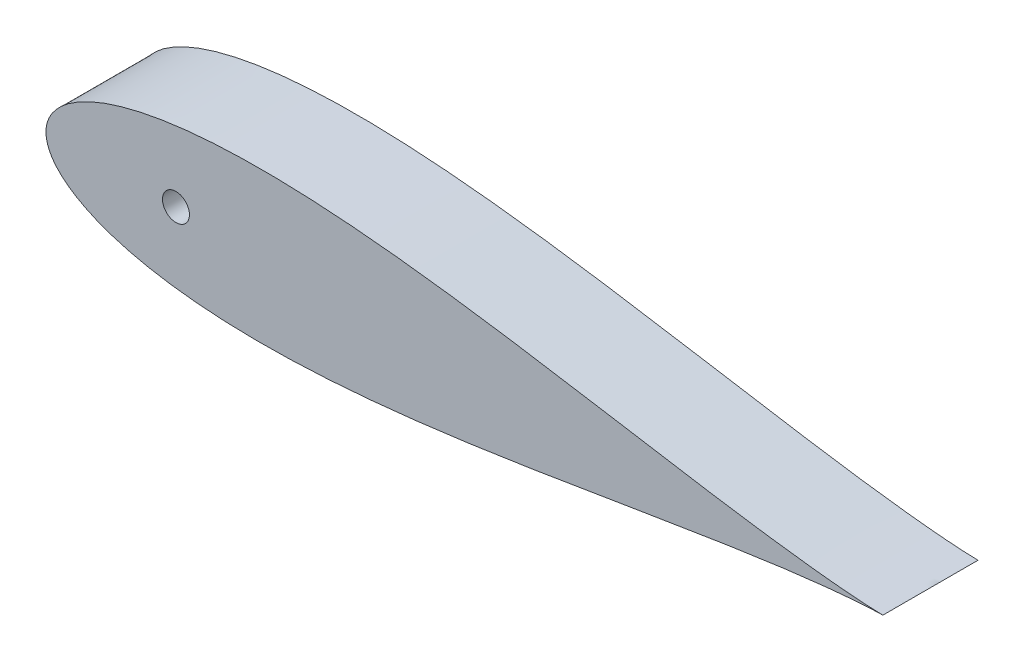
ISO-10303-21;
HEADER;
FILE_DESCRIPTION(('STEP AP214'),'2;1');
FILE_NAME('part.step','',(''),(''),'','','');
FILE_SCHEMA(('AUTOMOTIVE_DESIGN { 1 0 10303 214 1 1 1 1 }'));
ENDSEC;
DATA;
#1=APPLICATION_CONTEXT('core data for automotive mechanical design processes');
#2=APPLICATION_PROTOCOL_DEFINITION('international standard','automotive_design',2000,#1);
#3=PRODUCT_CONTEXT('',#1,'mechanical');
#4=PRODUCT('Part','Part','',(#3));
#5=PRODUCT_RELATED_PRODUCT_CATEGORY('part','',(#4));
#6=PRODUCT_DEFINITION_FORMATION('','',#4);
#7=PRODUCT_DEFINITION_CONTEXT('part definition',#1,'design');
#8=PRODUCT_DEFINITION('design','',#6,#7);
#9=PRODUCT_DEFINITION_SHAPE('','',#8);
#10=(LENGTH_UNIT() NAMED_UNIT(*) SI_UNIT(.MILLI.,.METRE.));
#11=(NAMED_UNIT(*) PLANE_ANGLE_UNIT() SI_UNIT($,.RADIAN.));
#12=(NAMED_UNIT(*) SI_UNIT($,.STERADIAN.) SOLID_ANGLE_UNIT());
#13=UNCERTAINTY_MEASURE_WITH_UNIT(LENGTH_MEASURE(1.E-05),#10,'distance_accuracy_value','');
#14=(GEOMETRIC_REPRESENTATION_CONTEXT(3) GLOBAL_UNCERTAINTY_ASSIGNED_CONTEXT((#13)) GLOBAL_UNIT_ASSIGNED_CONTEXT((#10,
#11,#12)) REPRESENTATION_CONTEXT('',''));
#15=CARTESIAN_POINT('',(0.,0.,0.));
#16=DIRECTION('',(0.,0.,1.));
#17=DIRECTION('',(1.,0.,0.));
#18=AXIS2_PLACEMENT_3D('',#15,#16,#17);
#19=CARTESIAN_POINT('',(670.56,0.,76.2));
#20=CARTESIAN_POINT('',(670.56,0.0156785949268131,76.2));
#21=CARTESIAN_POINT('',(666.344759682885,0.0546967077380254,76.2));
#22=CARTESIAN_POINT('',(662.850933167967,0.234427605388554,76.2));
#23=CARTESIAN_POINT('',(656.504964310749,0.543558382914671,76.2));
#24=CARTESIAN_POINT('',(649.292951764021,1.03477125279464,76.2));
#25=CARTESIAN_POINT('',(640.49155963975,1.73191957841822,76.2));
#26=CARTESIAN_POINT('',(630.413817461935,2.6633854932203,76.2));
#27=CARTESIAN_POINT('',(619.014124193102,3.84925366408521,76.2));
#28=CARTESIAN_POINT('',(606.37498851238,5.30442898343123,76.2));
#29=CARTESIAN_POINT('',(592.543922516217,7.03763490710039,76.2));
#30=CARTESIAN_POINT('',(577.585454095337,9.05063614704163,76.2));
#31=CARTESIAN_POINT('',(561.564270734499,11.338919624911,76.2));
#32=CARTESIAN_POINT('',(544.549749945783,13.8906653749143,76.2));
#33=CARTESIAN_POINT('',(526.614143657614,16.687720752969,76.2));
#34=CARTESIAN_POINT('',(507.832591566438,19.705111662944,76.2));
#35=CARTESIAN_POINT('',(488.28271028846,22.9116726009051,76.2));
#36=CARTESIAN_POINT('',(468.04436773457,26.2704360601485,76.2));
#37=CARTESIAN_POINT('',(447.199424328287,29.7390074319526,76.2));
#38=CARTESIAN_POINT('',(425.831595832134,33.2703241206413,76.2));
#39=CARTESIAN_POINT('',(404.026315660115,36.8132205450789,76.2));
#40=CARTESIAN_POINT('',(381.870662855574,40.3132668564462,76.2));
#41=CARTESIAN_POINT('',(359.45331489519,43.7135025323023,76.2));
#42=CARTESIAN_POINT('',(336.864544150043,46.9554474567625,76.2));
#43=CARTESIAN_POINT('',(314.196207315012,49.9798438951445,76.2));
#44=CARTESIAN_POINT('',(291.541767703989,52.7277127038914,76.2));
#45=CARTESIAN_POINT('',(268.996310773138,55.1412010116265,76.2));
#46=CARTESIAN_POINT('',(246.656558649997,57.164603828805,76.2));
#47=CARTESIAN_POINT('',(224.620860897201,58.7451766411797,76.2));
#48=CARTESIAN_POINT('',(202.989192599403,59.8341217002378,76.2));
#49=CARTESIAN_POINT('',(181.863132616042,60.38750614212,76.2));
#50=CARTESIAN_POINT('',(161.345829026568,60.3669613241372,76.2));
#51=CARTESIAN_POINT('',(141.542033827972,59.7398958243377,76.2));
#52=CARTESIAN_POINT('',(122.558104572902,58.4817581038394,76.2));
#53=CARTESIAN_POINT('',(104.502313427195,56.5743039322433,76.2));
#54=CARTESIAN_POINT('',(87.4850186361547,54.0089351991654,76.2));
#55=CARTESIAN_POINT('',(71.6196960831899,50.7847520029957,76.2));
#56=CARTESIAN_POINT('',(57.0237097246999,46.9125430655859,76.2));
#57=CARTESIAN_POINT('',(43.8204543300276,42.4150024601016,76.2));
#58=CARTESIAN_POINT('',(32.1416452388822,37.3322040286461,76.2));
#59=CARTESIAN_POINT('',(22.1291073753192,31.7314553388245,76.2));
#60=CARTESIAN_POINT('',(13.9324235239131,25.7264121059535,76.2));
#61=CARTESIAN_POINT('',(7.6896164890983,19.5132076319135,76.2));
#62=CARTESIAN_POINT('',(3.46313634309125,13.420354420661,76.2));
#63=CARTESIAN_POINT('',(1.10633322756685,7.92338943472272,76.2));
#64=CARTESIAN_POINT('',(0.15461158157361,3.51379661507287,76.2));
#65=CARTESIAN_POINT('',(-0.0621515976067641,1.5591281566194E-13,76.2));
#66=CARTESIAN_POINT('',(0.154611581573626,-3.51379661507311,76.2));
#67=CARTESIAN_POINT('',(1.10633322756686,-7.92338943472269,76.2));
#68=CARTESIAN_POINT('',(3.46313634309125,-13.420354420661,76.2));
#69=CARTESIAN_POINT('',(7.68961648909825,-19.5132076319134,76.2));
#70=CARTESIAN_POINT('',(13.9324235239131,-25.7264121059535,76.2));
#71=CARTESIAN_POINT('',(22.1291073753193,-31.7314553388245,76.2));
#72=CARTESIAN_POINT('',(32.1416452388821,-37.3322040286461,76.2));
#73=CARTESIAN_POINT('',(43.8204543300276,-42.4150024601017,76.2));
#74=CARTESIAN_POINT('',(57.0237097246998,-46.9125430655859,76.2));
#75=CARTESIAN_POINT('',(71.6196960831899,-50.7847520029958,76.2));
#76=CARTESIAN_POINT('',(87.4850186361546,-54.0089351991654,76.2));
#77=CARTESIAN_POINT('',(104.502313427195,-56.5743039322434,76.2));
#78=CARTESIAN_POINT('',(122.558104572901,-58.4817581038394,76.2));
#79=CARTESIAN_POINT('',(141.542033827972,-59.7398958243377,76.2));
#80=CARTESIAN_POINT('',(161.345829026568,-60.3669613241371,76.2));
#81=CARTESIAN_POINT('',(181.863132616042,-60.38750614212,76.2));
#82=CARTESIAN_POINT('',(202.989192599403,-59.8341217002379,76.2));
#83=CARTESIAN_POINT('',(224.620860897201,-58.7451766411797,76.2));
#84=CARTESIAN_POINT('',(246.656558649997,-57.164603828805,76.2));
#85=CARTESIAN_POINT('',(268.996310773138,-55.1412010116265,76.2));
#86=CARTESIAN_POINT('',(291.541767703989,-52.7277127038914,76.2));
#87=CARTESIAN_POINT('',(314.196207315012,-49.9798438951445,76.2));
#88=CARTESIAN_POINT('',(336.864544150043,-46.9554474567625,76.2));
#89=CARTESIAN_POINT('',(359.45331489519,-43.7135025323023,76.2));
#90=CARTESIAN_POINT('',(381.870662855574,-40.3132668564462,76.2));
#91=CARTESIAN_POINT('',(404.026315660115,-36.8132205450789,76.2));
#92=CARTESIAN_POINT('',(425.831595832134,-33.2703241206413,76.2));
#93=CARTESIAN_POINT('',(447.199424328287,-29.7390074319526,76.2));
#94=CARTESIAN_POINT('',(468.04436773457,-26.2704360601485,76.2));
#95=CARTESIAN_POINT('',(488.28271028846,-22.911672600905,76.2));
#96=CARTESIAN_POINT('',(507.832591566438,-19.7051116629441,76.2));
#97=CARTESIAN_POINT('',(526.614143657614,-16.687720752969,76.2));
#98=CARTESIAN_POINT('',(544.549749945782,-13.8906653749143,76.2));
#99=CARTESIAN_POINT('',(561.564270734499,-11.338919624911,76.2));
#100=CARTESIAN_POINT('',(577.585454095337,-9.05063614704163,76.2));
#101=CARTESIAN_POINT('',(592.543922516217,-7.03763490710038,76.2));
#102=CARTESIAN_POINT('',(606.37498851238,-5.30442898343123,76.2));
#103=CARTESIAN_POINT('',(619.014124193101,-3.84925366408522,76.2));
#104=CARTESIAN_POINT('',(630.413817461935,-2.6633854932203,76.2));
#105=CARTESIAN_POINT('',(640.491559639751,-1.73191957841821,76.2));
#106=CARTESIAN_POINT('',(649.29295176402,-1.03477125279464,76.2));
#107=CARTESIAN_POINT('',(656.504964310749,-0.543558382914674,76.2));
#108=CARTESIAN_POINT('',(662.850933167967,-0.23442760538855,76.2));
#109=CARTESIAN_POINT('',(666.344759682885,-0.0546967077380269,76.2));
#110=CARTESIAN_POINT('',(670.56,-0.0156785949268135,76.2));
#111=CARTESIAN_POINT('',(670.56,0.,76.2));
#112=B_SPLINE_CURVE_WITH_KNOTS('',3,(#19,#20,#21,#22,#23,#24,#25,#26,#27,#28,#29,#30,#31,#32,
#33,#34,#35,#36,#37,#38,#39,#40,#41,#42,#43,#44,#45,#46,#47,#48,#49,#50,#51,#52,#53,#54,#55,#56,
#57,#58,#59,#60,#61,#62,#63,#64,#65,#66,#67,#68,#69,#70,#71,#72,#73,#74,#75,#76,#77,#78,#79,#80,
#81,#82,#83,#84,#85,#86,#87,#88,#89,#90,#91,#92,#93,#94,#95,#96,#97,#98,#99,#100,#101,#102,#103,
#104,#105,#106,#107,#108,#109,#110,#111),.UNSPECIFIED.,.T.,.F.,(4,1,1,1,1,1,1,1,1,1,1,1,1,1,1,1,
1,1,1,1,1,1,1,1,1,1,1,1,1,1,1,1,1,1,1,1,1,1,1,1,1,1,1,1,1,1,1,1,1,1,1,1,1,1,1,1,1,1,1,1,1,1,1,1,
1,1,1,1,1,1,1,1,1,1,1,1,1,1,1,1,1,1,1,1,1,1,1,1,1,1,4),(0.,0.00216777795588342,
0.00539478220000884,0.00966720698444134,0.0149667883303173,0.0212708876900959,
0.0285525550130683,0.0367806836725549,0.0459201019032637,0.0559317636633187,0.0667728836144854,
0.0783971303496518,0.0907548266908363,0.103793164577546,0.117456431914319,0.131686225652521,
0.146421738497113,0.161599998000845,0.177156132626574,0.193023668070302,0.209134785631037,
0.225420632511523,0.241811601924249,0.258237646860869,0.274628556698349,0.290914287398014,
0.307025228908797,0.322892517177238,0.33844834182358,0.353626206573582,0.368361231970712,
0.382590427827798,0.396252960572084,0.40929041186716,0.421647009590256,0.433269881487031,
0.444109248914041,0.454118639688981,0.463255054987312,0.471479113777303,0.478755288570903,
0.485052318112802,0.490344025694165,0.494609832614287,0.497833231437255,0.5,0.502166768562745,
0.505390167385713,0.509655974305835,0.514947681887198,0.521244711429097,0.528520886222697,
0.536744945012688,0.545881360311019,0.555890751085959,0.566730118512969,0.578352990409744,
0.59070958813284,0.603747039427916,0.617409572172202,0.631638768029288,0.646373793426418,
0.66155165817642,0.677107482822761,0.692974771091203,0.709085712601986,0.725371443301651,
0.741762353139131,0.758188398075751,0.774579367488477,0.790865214368963,0.806976331929698,
0.822843867373426,0.838400001999155,0.853578261502887,0.868313774347479,0.882543568085681,
0.896206835422454,0.909245173309164,0.921602869650348,0.933227116385514,0.944068236336681,
0.954079898096736,0.963219316327445,0.971447444986932,0.978729112309904,0.985033211669683,
0.990332793015559,0.994605217799991,0.997832222044117,1.),.UNSPECIFIED.);
#113=DIRECTION('',(0.,0.,-1.));
#114=VECTOR('',#113,1.);
#115=SURFACE_OF_LINEAR_EXTRUSION('',#112,#114);
#116=CARTESIAN_POINT('',(670.56,0.,76.2));
#117=VERTEX_POINT('',#116);
#118=EDGE_CURVE('E10',#117,#117,#112,.T.);
#119=ORIENTED_EDGE('',*,*,#118,.F.);
#120=EDGE_LOOP('',(#119));
#121=FACE_BOUND('',#120,.T.);
#122=CARTESIAN_POINT('',(670.56,0.,0.));
#123=CARTESIAN_POINT('',(670.56,0.0156785949268131,0.));
#124=CARTESIAN_POINT('',(666.344759682885,0.0546967077380254,0.));
#125=CARTESIAN_POINT('',(662.850933167967,0.234427605388554,0.));
#126=CARTESIAN_POINT('',(656.504964310749,0.543558382914671,0.));
#127=CARTESIAN_POINT('',(649.292951764021,1.03477125279464,0.));
#128=CARTESIAN_POINT('',(640.49155963975,1.73191957841822,0.));
#129=CARTESIAN_POINT('',(630.413817461935,2.6633854932203,0.));
#130=CARTESIAN_POINT('',(619.014124193102,3.84925366408521,0.));
#131=CARTESIAN_POINT('',(606.37498851238,5.30442898343123,0.));
#132=CARTESIAN_POINT('',(592.543922516217,7.03763490710039,0.));
#133=CARTESIAN_POINT('',(577.585454095337,9.05063614704163,0.));
#134=CARTESIAN_POINT('',(561.564270734499,11.338919624911,0.));
#135=CARTESIAN_POINT('',(544.549749945783,13.8906653749143,0.));
#136=CARTESIAN_POINT('',(526.614143657614,16.687720752969,0.));
#137=CARTESIAN_POINT('',(507.832591566438,19.705111662944,0.));
#138=CARTESIAN_POINT('',(488.28271028846,22.9116726009051,0.));
#139=CARTESIAN_POINT('',(468.04436773457,26.2704360601485,0.));
#140=CARTESIAN_POINT('',(447.199424328287,29.7390074319526,0.));
#141=CARTESIAN_POINT('',(425.831595832134,33.2703241206413,0.));
#142=CARTESIAN_POINT('',(404.026315660115,36.8132205450789,0.));
#143=CARTESIAN_POINT('',(381.870662855574,40.3132668564462,0.));
#144=CARTESIAN_POINT('',(359.45331489519,43.7135025323023,0.));
#145=CARTESIAN_POINT('',(336.864544150043,46.9554474567625,0.));
#146=CARTESIAN_POINT('',(314.196207315012,49.9798438951445,0.));
#147=CARTESIAN_POINT('',(291.541767703989,52.7277127038914,0.));
#148=CARTESIAN_POINT('',(268.996310773138,55.1412010116265,0.));
#149=CARTESIAN_POINT('',(246.656558649997,57.164603828805,0.));
#150=CARTESIAN_POINT('',(224.620860897201,58.7451766411797,0.));
#151=CARTESIAN_POINT('',(202.989192599403,59.8341217002378,0.));
#152=CARTESIAN_POINT('',(181.863132616042,60.38750614212,0.));
#153=CARTESIAN_POINT('',(161.345829026568,60.3669613241372,0.));
#154=CARTESIAN_POINT('',(141.542033827972,59.7398958243377,0.));
#155=CARTESIAN_POINT('',(122.558104572902,58.4817581038394,0.));
#156=CARTESIAN_POINT('',(104.502313427195,56.5743039322433,0.));
#157=CARTESIAN_POINT('',(87.4850186361547,54.0089351991654,0.));
#158=CARTESIAN_POINT('',(71.6196960831899,50.7847520029957,0.));
#159=CARTESIAN_POINT('',(57.0237097246999,46.9125430655859,0.));
#160=CARTESIAN_POINT('',(43.8204543300276,42.4150024601016,0.));
#161=CARTESIAN_POINT('',(32.1416452388822,37.3322040286461,0.));
#162=CARTESIAN_POINT('',(22.1291073753192,31.7314553388245,0.));
#163=CARTESIAN_POINT('',(13.9324235239131,25.7264121059535,0.));
#164=CARTESIAN_POINT('',(7.6896164890983,19.5132076319135,0.));
#165=CARTESIAN_POINT('',(3.46313634309125,13.420354420661,0.));
#166=CARTESIAN_POINT('',(1.10633322756685,7.92338943472272,0.));
#167=CARTESIAN_POINT('',(0.15461158157361,3.51379661507287,0.));
#168=CARTESIAN_POINT('',(-0.0621515976067641,1.5591281566194E-13,0.));
#169=CARTESIAN_POINT('',(0.154611581573626,-3.51379661507311,0.));
#170=CARTESIAN_POINT('',(1.10633322756686,-7.92338943472269,0.));
#171=CARTESIAN_POINT('',(3.46313634309125,-13.420354420661,0.));
#172=CARTESIAN_POINT('',(7.68961648909825,-19.5132076319134,0.));
#173=CARTESIAN_POINT('',(13.9324235239131,-25.7264121059535,0.));
#174=CARTESIAN_POINT('',(22.1291073753193,-31.7314553388245,0.));
#175=CARTESIAN_POINT('',(32.1416452388821,-37.3322040286461,0.));
#176=CARTESIAN_POINT('',(43.8204543300276,-42.4150024601017,0.));
#177=CARTESIAN_POINT('',(57.0237097246998,-46.9125430655859,0.));
#178=CARTESIAN_POINT('',(71.6196960831899,-50.7847520029958,0.));
#179=CARTESIAN_POINT('',(87.4850186361546,-54.0089351991654,0.));
#180=CARTESIAN_POINT('',(104.502313427195,-56.5743039322434,0.));
#181=CARTESIAN_POINT('',(122.558104572901,-58.4817581038394,0.));
#182=CARTESIAN_POINT('',(141.542033827972,-59.7398958243377,0.));
#183=CARTESIAN_POINT('',(161.345829026568,-60.3669613241371,0.));
#184=CARTESIAN_POINT('',(181.863132616042,-60.38750614212,0.));
#185=CARTESIAN_POINT('',(202.989192599403,-59.8341217002379,0.));
#186=CARTESIAN_POINT('',(224.620860897201,-58.7451766411797,0.));
#187=CARTESIAN_POINT('',(246.656558649997,-57.164603828805,0.));
#188=CARTESIAN_POINT('',(268.996310773138,-55.1412010116265,0.));
#189=CARTESIAN_POINT('',(291.541767703989,-52.7277127038914,0.));
#190=CARTESIAN_POINT('',(314.196207315012,-49.9798438951445,0.));
#191=CARTESIAN_POINT('',(336.864544150043,-46.9554474567625,0.));
#192=CARTESIAN_POINT('',(359.45331489519,-43.7135025323023,0.));
#193=CARTESIAN_POINT('',(381.870662855574,-40.3132668564462,0.));
#194=CARTESIAN_POINT('',(404.026315660115,-36.8132205450789,0.));
#195=CARTESIAN_POINT('',(425.831595832134,-33.2703241206413,0.));
#196=CARTESIAN_POINT('',(447.199424328287,-29.7390074319526,0.));
#197=CARTESIAN_POINT('',(468.04436773457,-26.2704360601485,0.));
#198=CARTESIAN_POINT('',(488.28271028846,-22.911672600905,0.));
#199=CARTESIAN_POINT('',(507.832591566438,-19.7051116629441,0.));
#200=CARTESIAN_POINT('',(526.614143657614,-16.687720752969,0.));
#201=CARTESIAN_POINT('',(544.549749945782,-13.8906653749143,0.));
#202=CARTESIAN_POINT('',(561.564270734499,-11.338919624911,0.));
#203=CARTESIAN_POINT('',(577.585454095337,-9.05063614704163,0.));
#204=CARTESIAN_POINT('',(592.543922516217,-7.03763490710038,0.));
#205=CARTESIAN_POINT('',(606.37498851238,-5.30442898343123,0.));
#206=CARTESIAN_POINT('',(619.014124193101,-3.84925366408522,0.));
#207=CARTESIAN_POINT('',(630.413817461935,-2.6633854932203,0.));
#208=CARTESIAN_POINT('',(640.491559639751,-1.73191957841821,0.));
#209=CARTESIAN_POINT('',(649.29295176402,-1.03477125279464,0.));
#210=CARTESIAN_POINT('',(656.504964310749,-0.543558382914674,0.));
#211=CARTESIAN_POINT('',(662.850933167967,-0.23442760538855,0.));
#212=CARTESIAN_POINT('',(666.344759682885,-0.0546967077380269,0.));
#213=CARTESIAN_POINT('',(670.56,-0.0156785949268135,0.));
#214=CARTESIAN_POINT('',(670.56,0.,0.));
#215=B_SPLINE_CURVE_WITH_KNOTS('',3,(#122,#123,#124,#125,#126,#127,#128,#129,#130,#131,#132,
#133,#134,#135,#136,#137,#138,#139,#140,#141,#142,#143,#144,#145,#146,#147,#148,#149,#150,#151,
#152,#153,#154,#155,#156,#157,#158,#159,#160,#161,#162,#163,#164,#165,#166,#167,#168,#169,#170,
#171,#172,#173,#174,#175,#176,#177,#178,#179,#180,#181,#182,#183,#184,#185,#186,#187,#188,#189,
#190,#191,#192,#193,#194,#195,#196,#197,#198,#199,#200,#201,#202,#203,#204,#205,#206,#207,#208,
#209,#210,#211,#212,#213,#214),.UNSPECIFIED.,.T.,.F.,(4,1,1,1,1,1,1,1,1,1,1,1,1,1,1,1,1,1,1,1,1,
1,1,1,1,1,1,1,1,1,1,1,1,1,1,1,1,1,1,1,1,1,1,1,1,1,1,1,1,1,1,1,1,1,1,1,1,1,1,1,1,1,1,1,1,1,1,1,1,
1,1,1,1,1,1,1,1,1,1,1,1,1,1,1,1,1,1,1,1,1,4),(0.,0.00216777795588342,0.00539478220000884,
0.00966720698444134,0.0149667883303173,0.0212708876900959,0.0285525550130683,0.0367806836725549,
0.0459201019032637,0.0559317636633187,0.0667728836144854,0.0783971303496518,0.0907548266908363,
0.103793164577546,0.117456431914319,0.131686225652521,0.146421738497113,0.161599998000845,
0.177156132626574,0.193023668070302,0.209134785631037,0.225420632511523,0.241811601924249,
0.258237646860869,0.274628556698349,0.290914287398014,0.307025228908797,0.322892517177238,
0.33844834182358,0.353626206573582,0.368361231970712,0.382590427827798,0.396252960572084,
0.40929041186716,0.421647009590256,0.433269881487031,0.444109248914041,0.454118639688981,
0.463255054987312,0.471479113777303,0.478755288570903,0.485052318112802,0.490344025694165,
0.494609832614287,0.497833231437255,0.5,0.502166768562745,0.505390167385713,0.509655974305835,
0.514947681887198,0.521244711429097,0.528520886222697,0.536744945012688,0.545881360311019,
0.555890751085959,0.566730118512969,0.578352990409744,0.59070958813284,0.603747039427916,
0.617409572172202,0.631638768029288,0.646373793426418,0.66155165817642,0.677107482822761,
0.692974771091203,0.709085712601986,0.725371443301651,0.741762353139131,0.758188398075751,
0.774579367488477,0.790865214368963,0.806976331929698,0.822843867373426,0.838400001999155,
0.853578261502887,0.868313774347479,0.882543568085681,0.896206835422454,0.909245173309164,
0.921602869650348,0.933227116385514,0.944068236336681,0.954079898096736,0.963219316327445,
0.971447444986932,0.978729112309904,0.985033211669683,0.990332793015559,0.994605217799991,
0.997832222044117,1.),.UNSPECIFIED.);
#216=CARTESIAN_POINT('',(670.56,0.,0.));
#217=VERTEX_POINT('',#216);
#218=EDGE_CURVE('E43',#217,#217,#215,.T.);
#219=ORIENTED_EDGE('',*,*,#218,.T.);
#220=EDGE_LOOP('',(#219));
#221=FACE_BOUND('',#220,.T.);
#222=CARTESIAN_POINT('',(0.,0.,26.67));
#223=CARTESIAN_POINT('',(-3.36041450506648E-06,0.175314196786076,26.6700054650114));
#224=CARTESIAN_POINT('',(0.00188460795035636,0.350569566705454,26.6627387118511));
#225=CARTESIAN_POINT('',(0.00936355360579103,0.699849877807257,26.6337465421598));
#226=CARTESIAN_POINT('',(0.0149549335036686,0.873874683132755,26.6120195536185));
#227=CARTESIAN_POINT('',(0.029681400044405,1.21942753051114,26.5542762216843));
#228=CARTESIAN_POINT('',(0.0388175173013386,1.39095483136552,26.5182557224576));
#229=CARTESIAN_POINT('',(0.0603755179921427,1.73031472503642,26.4322144700857));
#230=CARTESIAN_POINT('',(0.0727986153066557,1.89814592803061,26.3821885443436));
#231=CARTESIAN_POINT('',(0.100563066813432,2.22862035192529,26.2686315853651));
#232=CARTESIAN_POINT('',(0.115899542392519,2.39127172251567,26.2051231087989));
#233=CARTESIAN_POINT('',(0.149085754266055,2.71060944006638,26.0650449309367));
#234=CARTESIAN_POINT('',(0.166936430559504,2.86729352804148,25.9884703422617));
#235=CARTESIAN_POINT('',(0.22354245860043,3.32669050626309,25.740020541774));
#236=CARTESIAN_POINT('',(0.265381469242041,3.61908372272387,25.5493033662753));
#237=CARTESIAN_POINT('',(0.353599105395794,4.17380628734976,25.1187030448393));
#238=CARTESIAN_POINT('',(0.400051006725998,4.43542871210424,24.8779241528534));
#239=CARTESIAN_POINT('',(0.468749392876288,4.79500314093503,24.486766625312));
#240=CARTESIAN_POINT('',(0.491498526459671,4.90944159874213,24.351295253127));
#241=CARTESIAN_POINT('',(0.536053290833178,5.12664673469544,24.0711806379211));
#242=CARTESIAN_POINT('',(0.557859271907102,5.22941776953107,23.9265408500927));
#243=CARTESIAN_POINT('',(0.600253730108386,5.4240957054075,23.6266826185875));
#244=CARTESIAN_POINT('',(0.620817775231838,5.51580713547434,23.4713339257966));
#245=CARTESIAN_POINT('',(0.659746845420819,5.6857501775542,23.1532390557705));
#246=CARTESIAN_POINT('',(0.678112716134525,5.76398697843916,22.9904957567332));
#247=CARTESIAN_POINT('',(0.712113303831603,5.90640956758361,22.6586802692055));
#248=CARTESIAN_POINT('',(0.727747817237967,5.97059430858724,22.4896076101065));
#249=CARTESIAN_POINT('',(0.755813386651112,6.08437224819195,22.1463630248041));
#250=CARTESIAN_POINT('',(0.768244521844887,6.13396580748899,21.9721912247692));
#251=CARTESIAN_POINT('',(0.789300318650266,6.2172510583822,21.6237276264596));
#252=CARTESIAN_POINT('',(0.797999209236737,6.25125387244207,21.4495146498628));
#253=CARTESIAN_POINT('',(0.811702847435575,6.30456852693388,21.0987106710498));
#254=CARTESIAN_POINT('',(0.81670764185613,6.32388055351404,20.9221196989943));
#255=CARTESIAN_POINT('',(0.8228719735796,6.34764139810869,20.5678987890873));
#256=CARTESIAN_POINT('',(0.824032057819526,6.35209233021885,20.3902690026162));
#257=CARTESIAN_POINT('',(0.822473319885574,6.34609693189409,20.0352794560266));
#258=CARTESIAN_POINT('',(0.819754551473747,6.33565080793678,19.8579196921996));
#259=CARTESIAN_POINT('',(0.810634250898212,6.30039436671076,19.509138348002));
#260=CARTESIAN_POINT('',(0.804324810186511,6.27594314609937,19.3376779101777));
#261=CARTESIAN_POINT('',(0.788271414824276,6.21314918469124,18.9974201924089));
#262=CARTESIAN_POINT('',(0.77852622329881,6.1748014409887,18.8286238944525));
#263=CARTESIAN_POINT('',(0.755880509728984,6.08454176144109,18.4949768160236));
#264=CARTESIAN_POINT('',(0.742981017537862,6.03263425237093,18.3301247670333));
#265=CARTESIAN_POINT('',(0.714378101256322,5.91563273302961,18.0053524893278));
#266=CARTESIAN_POINT('',(0.698673626686568,5.85053378126704,17.845434134709));
#267=CARTESIAN_POINT('',(0.664730978321617,5.70696259622184,17.5301304526191));
#268=CARTESIAN_POINT('',(0.646469987824301,5.62836830202246,17.374803177808));
#269=CARTESIAN_POINT('',(0.608023205441482,5.4587873381448,17.0712497918187));
#270=CARTESIAN_POINT('',(0.58783675167408,5.36779640245855,16.9230261490258));
#271=CARTESIAN_POINT('',(0.546088175262894,5.1740728641781,16.634672504297));
#272=CARTESIAN_POINT('',(0.524526078058805,5.07134047869008,16.4945423527799));
#273=CARTESIAN_POINT('',(0.480599024701973,4.85481139587405,16.2232414823361));
#274=CARTESIAN_POINT('',(0.458234052120178,4.74101447205348,16.0920709469077));
#275=CARTESIAN_POINT('',(0.412634098574004,4.49960126626211,15.8358083902864));
#276=CARTESIAN_POINT('',(0.389392803880418,4.37167813850995,15.7110063709034));
#277=CARTESIAN_POINT('',(0.343342937234403,4.10577336397087,15.4726298445276));
#278=CARTESIAN_POINT('',(0.320534224729006,3.96779505736292,15.3590516384244));
#279=CARTESIAN_POINT('',(0.275973436137455,3.68258724220721,15.1438062260866));
#280=CARTESIAN_POINT('',(0.2542218002064,3.53535393752007,15.0421439570593));
#281=CARTESIAN_POINT('',(0.212416145332486,3.2327183886442,14.8515451879097));
#282=CARTESIAN_POINT('',(0.192361471096532,3.07731933563821,14.7626037663043));
#283=CARTESIAN_POINT('',(0.15443124983724,2.75858152152457,14.5976683156001));
#284=CARTESIAN_POINT('',(0.136566592977728,2.59520831645106,14.5217382986827));
#285=CARTESIAN_POINT('',(0.10364435221405,2.26242179605448,14.3839773304717));
#286=CARTESIAN_POINT('',(0.0885856595251319,2.09301089820218,14.322140807929));
#287=CARTESIAN_POINT('',(0.0617046594414866,1.74930091917869,14.2130403211418));
#288=CARTESIAN_POINT('',(0.049882454383231,1.57500168363225,14.1657768176845));
#289=CARTESIAN_POINT('',(0.0298268304367386,1.22281461786051,14.0862361003388));
#290=CARTESIAN_POINT('',(0.0215933166970782,1.04492688261161,14.0539584903622));
#291=CARTESIAN_POINT('',(0.00913616831795557,0.69174278558812,14.0053419221511));
#292=CARTESIAN_POINT('',(0.00481041355013135,0.516505853151667,13.9885967255508));
#293=CARTESIAN_POINT('',(-7.13667299525946E-05,0.165195528446851,13.9697124082286));
#294=CARTESIAN_POINT('',(-0.000627462467155894,-0.0108778481782534,13.9675730154153));
#295=CARTESIAN_POINT('',(0.00204994924250336,-0.362549043366959,13.9779182364375));
#296=CARTESIAN_POINT('',(0.00528312353401966,-0.538146902377978,13.9904015646327));
#297=CARTESIAN_POINT('',(0.0154327963133517,-0.887594673970619,14.0298812849129));
#298=CARTESIAN_POINT('',(0.0223492820134852,-1.06144459261859,14.0568776266119));
#299=CARTESIAN_POINT('',(0.0395211988424881,-1.40331086593224,14.1245916107892));
#300=CARTESIAN_POINT('',(0.0497200504562146,-1.57137613089941,14.1650771245912));
#301=CARTESIAN_POINT('',(0.0732094891794601,-1.90350836715523,14.2595564163444));
#302=CARTESIAN_POINT('',(0.0865011909070174,-2.06757387338361,14.3135550647629));
#303=CARTESIAN_POINT('',(0.115812684456319,-2.390503012412,14.4346178896455));
#304=CARTESIAN_POINT('',(0.13183169989164,-2.5493681103136,14.5016783485746));
#305=CARTESIAN_POINT('',(0.166186164225192,-2.86097531633601,14.648405028107));
#306=CARTESIAN_POINT('',(0.184522481206993,-3.01371510146149,14.7280759755595));
#307=CARTESIAN_POINT('',(0.223382965160384,-3.31483824359715,14.9010465440186));
#308=CARTESIAN_POINT('',(0.243941616965101,-3.46308683061278,14.994573048121));
#309=CARTESIAN_POINT('',(0.286390928891739,-3.75127164493444,15.1934878116626));
#310=CARTESIAN_POINT('',(0.308282049637927,-3.89120496429937,15.2988801838624));
#311=CARTESIAN_POINT('',(0.352795163829214,-4.16182065333003,15.5207950556313));
#312=CARTESIAN_POINT('',(0.375417148870229,-4.29250312931452,15.6373174272485));
#313=CARTESIAN_POINT('',(0.420783585780344,-4.54379440082686,15.8807394706026));
#314=CARTESIAN_POINT('',(0.443528039047907,-4.66440308106127,16.007639261075));
#315=CARTESIAN_POINT('',(0.489118525692922,-4.89778783225403,16.274458742457));
#316=CARTESIAN_POINT('',(0.511951662014824,-5.01027660286625,16.4146321280428));
#317=CARTESIAN_POINT('',(0.55644987563061,-5.2230126911102,16.7040787384747));
#318=CARTESIAN_POINT('',(0.578115351909914,-5.32326420517183,16.8533488173852));
#319=CARTESIAN_POINT('',(0.619674392631512,-5.51088013296822,17.1600897467311));
#320=CARTESIAN_POINT('',(0.639567336585268,-5.59824004086447,17.3175634385734));
#321=CARTESIAN_POINT('',(0.676987108655061,-5.75933533845508,17.6395252028729));
#322=CARTESIAN_POINT('',(0.694514886244835,-5.83307619979666,17.8040104255125));
#323=CARTESIAN_POINT('',(0.726595088247062,-5.96597203351996,18.1378556831911));
#324=CARTESIAN_POINT('',(0.741165398416609,-6.0252151606839,18.3071788896069));
#325=CARTESIAN_POINT('',(0.767028654769059,-6.12919821107583,18.6503985933522));
#326=CARTESIAN_POINT('',(0.778322845143193,-6.17394364093657,18.8242933270898));
#327=CARTESIAN_POINT('',(0.797299765617693,-6.24857585932516,19.1754397800347));
#328=CARTESIAN_POINT('',(0.80498246979334,-6.27846254119095,19.3526915233306));
#329=CARTESIAN_POINT('',(0.816500487838118,-6.32310932628156,19.7092126402182));
#330=CARTESIAN_POINT('',(0.82033589507832,-6.33786979660861,19.888481964738));
#331=CARTESIAN_POINT('',(0.823987329025285,-6.35192332131187,20.2424227615439));
#332=CARTESIAN_POINT('',(0.823917353961725,-6.35165506382048,20.4170757895674));
#333=CARTESIAN_POINT('',(0.820042644307236,-6.33673993706701,20.765724635516));
#334=CARTESIAN_POINT('',(0.816237941090812,-6.322093188595,20.9397204589497));
#335=CARTESIAN_POINT('',(0.805004830668955,-6.27854763007134,21.2857923788836));
#336=CARTESIAN_POINT('',(0.797576560515154,-6.24964935904459,21.4578685477377));
#337=CARTESIAN_POINT('',(0.779311007230982,-6.17784391747698,21.7988872417882));
#338=CARTESIAN_POINT('',(0.768473707678528,-6.13493667945164,21.9678297518849));
#339=CARTESIAN_POINT('',(0.743778406428794,-6.03578099757094,22.3003423009548));
#340=CARTESIAN_POINT('',(0.72994013069913,-5.97961947323177,22.4639397525828));
#341=CARTESIAN_POINT('',(0.699581336496635,-5.85422364118801,22.7858495210389));
#342=CARTESIAN_POINT('',(0.683059910659203,-5.78498490985078,22.9441600280624));
#343=CARTESIAN_POINT('',(0.647791986512205,-5.6339750366798,23.2543787854092));
#344=CARTESIAN_POINT('',(0.629046010375384,-5.55220683460417,23.4062885268957));
#345=CARTESIAN_POINT('',(0.589820343445828,-5.37666952358285,23.7028429103333));
#346=CARTESIAN_POINT('',(0.569340038486793,-5.28289615726123,23.8474849494866));
#347=CARTESIAN_POINT('',(0.526644600735225,-5.08141976927584,24.1322000043783));
#348=CARTESIAN_POINT('',(0.504398271024523,-4.97341882961921,24.2720575965381));
#349=CARTESIAN_POINT('',(0.45926482102742,-4.74619938959331,24.5422326890344));
#350=CARTESIAN_POINT('',(0.436377689207983,-4.62698068723759,24.6725500175143));
#351=CARTESIAN_POINT('',(0.390577983382903,-4.37805700602659,24.9228559558385));
#352=CARTESIAN_POINT('',(0.367665402803702,-4.24834776395754,25.042840325193));
#353=CARTESIAN_POINT('',(0.322459086855767,-3.97936837853775,25.271594391194));
#354=CARTESIAN_POINT('',(0.300165142888973,-3.84010151431458,25.3803679024501));
#355=CARTESIAN_POINT('',(0.256373306847201,-3.5500163482251,25.5880477584336));
#356=CARTESIAN_POINT('',(0.234899865043804,-3.39902411207604,25.6867165260437));
#357=CARTESIAN_POINT('',(0.193864691058338,-3.08905915036462,25.8709194626594));
#358=CARTESIAN_POINT('',(0.174302258770723,-2.93008937995526,25.9564584484209));
#359=CARTESIAN_POINT('',(0.137658419517079,-2.6052679224621,26.1137567529431));
#360=CARTESIAN_POINT('',(0.120575981657022,-2.43941913195007,26.1855218013274));
#361=CARTESIAN_POINT('',(0.089375266392952,-2.10201807250879,26.3147205280289));
#362=CARTESIAN_POINT('',(0.0752565561209833,-1.93046664072581,26.3721562994434));
#363=CARTESIAN_POINT('',(0.0424864710325741,-1.47206741127599,26.5040989730884));
#364=CARTESIAN_POINT('',(0.0266705314354681,-1.18133856978033,26.5662003511669));
#365=CARTESIAN_POINT('',(0.00543058494785095,-0.59368327822627,26.6491444728425));
#366=CARTESIAN_POINT('',(5.68823152281858E-06,-0.296757361049317,26.669990749281));
#367=CARTESIAN_POINT('',(0.,0.,26.67));
#368=B_SPLINE_CURVE_WITH_KNOTS('',3,(#222,#223,#224,#225,#226,#227,#228,#229,#230,#231,#232,
#233,#234,#235,#236,#237,#238,#239,#240,#241,#242,#243,#244,#245,#246,#247,#248,#249,#250,#251,
#252,#253,#254,#255,#256,#257,#258,#259,#260,#261,#262,#263,#264,#265,#266,#267,#268,#269,#270,
#271,#272,#273,#274,#275,#276,#277,#278,#279,#280,#281,#282,#283,#284,#285,#286,#287,#288,#289,
#290,#291,#292,#293,#294,#295,#296,#297,#298,#299,#300,#301,#302,#303,#304,#305,#306,#307,#308,
#309,#310,#311,#312,#313,#314,#315,#316,#317,#318,#319,#320,#321,#322,#323,#324,#325,#326,#327,
#328,#329,#330,#331,#332,#333,#334,#335,#336,#337,#338,#339,#340,#341,#342,#343,#344,#345,#346,
#347,#348,#349,#350,#351,#352,#353,#354,#355,#356,#357,#358,#359,#360,#361,#362,#363,#364,#365,
#366,#367),.UNSPECIFIED.,.T.,.F.,(4,2,2,2,2,2,2,2,2,2,2,2,2,2,2,2,2,2,2,2,2,2,2,2,2,2,2,2,2,2,2,
2,2,2,2,2,2,2,2,2,2,2,2,2,2,2,2,2,2,2,2,2,2,2,2,2,2,2,2,2,2,2,2,2,2,2,2,2,2,2,2,2,4),(0.,
0.525680755711654,1.05141866889969,1.57730955235216,2.10339491886465,2.62860697057245,
3.1540159102334,4.20377805545433,5.27425055770608,5.81010905789046,6.34576680238514,
6.88981810152156,7.43365942417046,7.97754126381742,8.52140965750285,9.05389403719225,
9.58637166961378,10.1187735501022,10.651168051414,11.1704865488972,11.6899921929646,
12.209328448647,12.7288596076185,13.2533644231198,13.7780501924903,14.3027262616878,
14.8274130733366,15.3674462369889,15.9073008203662,16.4473783003373,16.9872462648596,
17.5296983773299,18.0719356816137,18.614190129249,19.1564302438806,19.6840518314147,
20.2116635898641,20.7392289637879,21.2667925061276,21.7857098428403,22.3048144802198,
22.8237715900247,23.3429236856652,23.8717784186895,24.4008170226321,24.9298495454145,
25.4588881220834,26.0017611579605,26.5444475043551,27.0873230819974,27.6299800748588,
28.1692504859319,28.7083158261739,29.2473850359873,29.7864411626701,30.3097706922869,
30.8330958255824,31.3564011670528,31.8797090294448,32.3996760735648,32.9198193232148,
33.4398407193063,33.9600470434165,34.4937292362394,35.0274210403558,35.5613308300454,
36.0950583474849,36.6393372357526,37.1834159716594,37.7272678911562,38.2710403228755,
39.1609454034817,40.0507742746127),.UNSPECIFIED.);
#369=CARTESIAN_POINT('',(0.,0.,26.67));
#370=VERTEX_POINT('',#369);
#371=EDGE_CURVE('E36',#370,#370,#368,.T.);
#372=ORIENTED_EDGE('',*,*,#371,.F.);
#373=EDGE_LOOP('',(#372));
#374=FACE_BOUND('',#373,.T.);
#375=ADVANCED_FACE('F31',(#121,#221,#374),#115,.F.);
#376=CARTESIAN_POINT('',(0.,1.54838793559665E-13,76.2));
#377=DIRECTION('',(0.,0.,-1.));
#378=DIRECTION('',(-1.,0.,0.));
#379=AXIS2_PLACEMENT_3D('',#376,#377,#378);
#380=PLANE('',#379);
#381=CARTESIAN_POINT('',(104.139232412,0.,76.2));
#382=DIRECTION('',(0.,0.,1.));
#383=DIRECTION('',(1.,0.,0.));
#384=AXIS2_PLACEMENT_3D('',#381,#382,#383);
#385=CIRCLE('',#384,10.795);
#386=CARTESIAN_POINT('',(114.934232412,0.,76.2));
#387=VERTEX_POINT('',#386);
#388=EDGE_CURVE('E52',#387,#387,#385,.T.);
#389=ORIENTED_EDGE('',*,*,#388,.F.);
#390=EDGE_LOOP('',(#389));
#391=FACE_BOUND('',#390,.T.);
#392=ORIENTED_EDGE('',*,*,#118,.T.);
#393=EDGE_LOOP('',(#392));
#394=FACE_BOUND('',#393,.T.);
#395=ADVANCED_FACE('F75',(#391,#394),#380,.F.);
#396=CARTESIAN_POINT('',(0.,1.54838793559665E-13,0.));
#397=DIRECTION('',(0.,0.,-1.));
#398=DIRECTION('',(-1.,0.,0.));
#399=AXIS2_PLACEMENT_3D('',#396,#397,#398);
#400=PLANE('',#399);
#401=CARTESIAN_POINT('',(104.139232412,0.,0.));
#402=DIRECTION('',(0.,0.,1.));
#403=DIRECTION('',(1.,0.,0.));
#404=AXIS2_PLACEMENT_3D('',#401,#402,#403);
#405=CIRCLE('',#404,10.795);
#406=CARTESIAN_POINT('',(114.934232412,0.,0.));
#407=VERTEX_POINT('',#406);
#408=EDGE_CURVE('E47',#407,#407,#405,.T.);
#409=ORIENTED_EDGE('',*,*,#408,.T.);
#410=EDGE_LOOP('',(#409));
#411=FACE_BOUND('',#410,.T.);
#412=ORIENTED_EDGE('',*,*,#218,.F.);
#413=EDGE_LOOP('',(#412));
#414=FACE_BOUND('',#413,.T.);
#415=ADVANCED_FACE('F82',(#411,#414),#400,.T.);
#416=CARTESIAN_POINT('',(104.139232412,0.,0.));
#417=DIRECTION('',(0.,0.,1.));
#418=DIRECTION('',(1.,0.,0.));
#419=AXIS2_PLACEMENT_3D('',#416,#417,#418);
#420=CYLINDRICAL_SURFACE('',#419,10.795);
#421=ORIENTED_EDGE('',*,*,#408,.F.);
#422=EDGE_LOOP('',(#421));
#423=FACE_BOUND('',#422,.T.);
#424=ORIENTED_EDGE('',*,*,#388,.T.);
#425=EDGE_LOOP('',(#424));
#426=FACE_BOUND('',#425,.T.);
#427=ADVANCED_FACE('F89',(#423,#426),#420,.F.);
#428=CARTESIAN_POINT('',(53.34,0.,20.32));
#429=DIRECTION('',(-1.,0.,0.));
#430=DIRECTION('',(0.,0.,1.));
#431=AXIS2_PLACEMENT_3D('',#428,#429,#430);
#432=CYLINDRICAL_SURFACE('',#431,6.35);
#433=CARTESIAN_POINT('',(53.34,0.,20.32));
#434=DIRECTION('',(1.,0.,0.));
#435=DIRECTION('',(0.,0.,-1.));
#436=AXIS2_PLACEMENT_3D('',#433,#434,#435);
#437=CIRCLE('',#436,6.35);
#438=CARTESIAN_POINT('',(53.34,0.,13.97));
#439=VERTEX_POINT('',#438);
#440=EDGE_CURVE('E65',#439,#439,#437,.T.);
#441=ORIENTED_EDGE('',*,*,#440,.T.);
#442=EDGE_LOOP('',(#441));
#443=FACE_BOUND('',#442,.T.);
#444=ORIENTED_EDGE('',*,*,#371,.T.);
#445=EDGE_LOOP('',(#444));
#446=FACE_BOUND('',#445,.T.);
#447=ADVANCED_FACE('F72',(#443,#446),#432,.F.);
#448=CARTESIAN_POINT('',(53.34,0.,20.32));
#449=DIRECTION('',(1.,0.,0.));
#450=DIRECTION('',(0.,0.,-1.));
#451=AXIS2_PLACEMENT_3D('',#448,#449,#450);
#452=PLANE('',#451);
#453=ORIENTED_EDGE('',*,*,#440,.F.);
#454=EDGE_LOOP('',(#453));
#455=FACE_BOUND('',#454,.T.);
#456=ADVANCED_FACE('F99',(#455),#452,.F.);
#457=CLOSED_SHELL('',(#375,#395,#415,#427,#447,#456));
#458=MANIFOLD_SOLID_BREP('B2',#457);
#459=ADVANCED_BREP_SHAPE_REPRESENTATION('',(#18,#458),#14);
#460=SHAPE_DEFINITION_REPRESENTATION(#9,#459);
ENDSEC;
END-ISO-10303-21;
